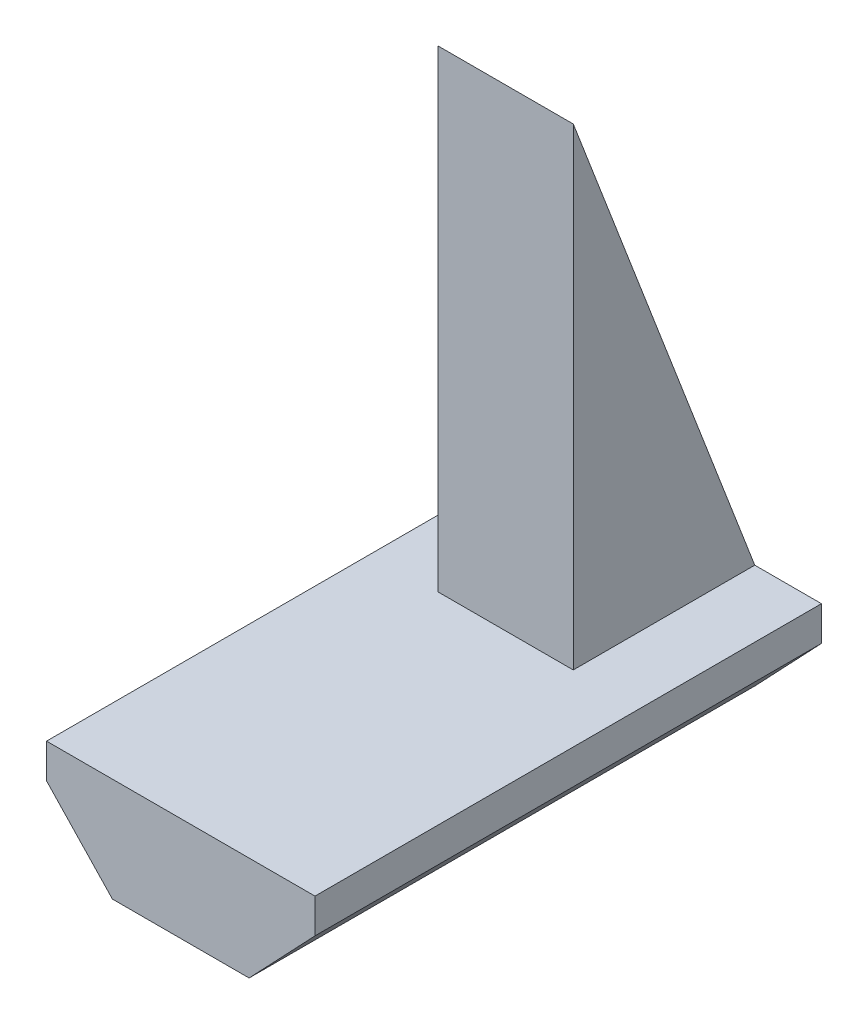
ISO-10303-21;
HEADER;
FILE_DESCRIPTION(('STEP AP214'),'2;1');
FILE_NAME('part.step','',(''),(''),'','','');
FILE_SCHEMA(('AUTOMOTIVE_DESIGN { 1 0 10303 214 1 1 1 1 }'));
ENDSEC;
DATA;
#1=APPLICATION_CONTEXT('core data for automotive mechanical design processes');
#2=APPLICATION_PROTOCOL_DEFINITION('international standard','automotive_design',2000,#1);
#3=PRODUCT_CONTEXT('',#1,'mechanical');
#4=PRODUCT('Part','Part','',(#3));
#5=PRODUCT_RELATED_PRODUCT_CATEGORY('part','',(#4));
#6=PRODUCT_DEFINITION_FORMATION('','',#4);
#7=PRODUCT_DEFINITION_CONTEXT('part definition',#1,'design');
#8=PRODUCT_DEFINITION('design','',#6,#7);
#9=PRODUCT_DEFINITION_SHAPE('','',#8);
#10=(LENGTH_UNIT() NAMED_UNIT(*) SI_UNIT(.MILLI.,.METRE.));
#11=(NAMED_UNIT(*) PLANE_ANGLE_UNIT() SI_UNIT($,.RADIAN.));
#12=(NAMED_UNIT(*) SI_UNIT($,.STERADIAN.) SOLID_ANGLE_UNIT());
#13=UNCERTAINTY_MEASURE_WITH_UNIT(LENGTH_MEASURE(1.E-05),#10,'distance_accuracy_value','');
#14=(GEOMETRIC_REPRESENTATION_CONTEXT(3) GLOBAL_UNCERTAINTY_ASSIGNED_CONTEXT((#13)) GLOBAL_UNIT_ASSIGNED_CONTEXT((#10,
#11,#12)) REPRESENTATION_CONTEXT('',''));
#15=CARTESIAN_POINT('',(0.,0.,0.));
#16=DIRECTION('',(0.,0.,1.));
#17=DIRECTION('',(1.,0.,0.));
#18=AXIS2_PLACEMENT_3D('',#15,#16,#17);
#19=CARTESIAN_POINT('',(0.,0.,30.));
#20=DIRECTION('',(0.,1.,0.));
#21=DIRECTION('',(-1.,0.,0.));
#22=AXIS2_PLACEMENT_3D('',#19,#20,#21);
#23=PLANE('',#22);
#24=DIRECTION('',(1.,0.,0.));
#25=VECTOR('',#24,1.);
#26=CARTESIAN_POINT('',(0.,0.,0.));
#27=LINE('',#26,#25);
#28=CARTESIAN_POINT('',(4.,0.,0.));
#29=VERTEX_POINT('',#28);
#30=CARTESIAN_POINT('',(7.95,0.,0.));
#31=VERTEX_POINT('',#30);
#32=EDGE_CURVE('E64',#29,#31,#27,.T.);
#33=ORIENTED_EDGE('',*,*,#32,.F.);
#34=DIRECTION('',(0.,0.,1.));
#35=VECTOR('',#34,1.);
#36=CARTESIAN_POINT('',(4.,0.,10.7510384863591));
#37=LINE('',#36,#35);
#38=CARTESIAN_POINT('',(4.,0.,10.7510384863591));
#39=VERTEX_POINT('',#38);
#40=EDGE_CURVE('E59',#29,#39,#37,.T.);
#41=ORIENTED_EDGE('',*,*,#40,.T.);
#42=DIRECTION('',(1.,0.,0.));
#43=VECTOR('',#42,1.);
#44=CARTESIAN_POINT('',(-4.,0.,10.7510384863591));
#45=LINE('',#44,#43);
#46=CARTESIAN_POINT('',(-4.,0.,10.7510384863591));
#47=VERTEX_POINT('',#46);
#48=EDGE_CURVE('E111',#47,#39,#45,.T.);
#49=ORIENTED_EDGE('',*,*,#48,.F.);
#50=DIRECTION('',(0.,0.,1.));
#51=VECTOR('',#50,1.);
#52=CARTESIAN_POINT('',(-4.,0.,10.7510384863591));
#53=LINE('',#52,#51);
#54=CARTESIAN_POINT('',(-4.,0.,0.));
#55=VERTEX_POINT('',#54);
#56=EDGE_CURVE('E115',#55,#47,#53,.T.);
#57=ORIENTED_EDGE('',*,*,#56,.F.);
#58=CARTESIAN_POINT('',(-7.95,0.,0.));
#59=VERTEX_POINT('',#58);
#60=EDGE_CURVE('E158',#59,#55,#27,.T.);
#61=ORIENTED_EDGE('',*,*,#60,.F.);
#62=DIRECTION('',(0.,0.,-1.));
#63=VECTOR('',#62,1.);
#64=CARTESIAN_POINT('',(-7.95,0.,30.));
#65=LINE('',#64,#63);
#66=CARTESIAN_POINT('',(-7.95,0.,30.));
#67=VERTEX_POINT('',#66);
#68=EDGE_CURVE('E178',#67,#59,#65,.T.);
#69=ORIENTED_EDGE('',*,*,#68,.F.);
#70=DIRECTION('',(1.,0.,0.));
#71=VECTOR('',#70,1.);
#72=CARTESIAN_POINT('',(0.,0.,30.));
#73=LINE('',#72,#71);
#74=CARTESIAN_POINT('',(7.95,0.,30.));
#75=VERTEX_POINT('',#74);
#76=EDGE_CURVE('E174',#67,#75,#73,.T.);
#77=ORIENTED_EDGE('',*,*,#76,.T.);
#78=DIRECTION('',(0.,0.,-1.));
#79=VECTOR('',#78,1.);
#80=CARTESIAN_POINT('',(7.95,0.,30.));
#81=LINE('',#80,#79);
#82=EDGE_CURVE('E202',#75,#31,#81,.T.);
#83=ORIENTED_EDGE('',*,*,#82,.T.);
#84=EDGE_LOOP('',(#33,#41,#49,#57,#61,#69,#77,#83));
#85=FACE_BOUND('',#84,.T.);
#86=ADVANCED_FACE('F43',(#85),#23,.T.);
#87=CARTESIAN_POINT('',(-7.95,0.,30.));
#88=DIRECTION('',(-1.,0.,0.));
#89=DIRECTION('',(0.,-1.,0.));
#90=AXIS2_PLACEMENT_3D('',#87,#88,#89);
#91=PLANE('',#90);
#92=DIRECTION('',(0.,1.,0.));
#93=VECTOR('',#92,1.);
#94=CARTESIAN_POINT('',(-7.95,0.,0.));
#95=LINE('',#94,#93);
#96=CARTESIAN_POINT('',(-7.95,-2.04,0.));
#97=VERTEX_POINT('',#96);
#98=EDGE_CURVE('E119',#97,#59,#95,.T.);
#99=ORIENTED_EDGE('',*,*,#98,.F.);
#100=DIRECTION('',(0.,0.,-1.));
#101=VECTOR('',#100,1.);
#102=CARTESIAN_POINT('',(-7.95,-2.04,30.));
#103=LINE('',#102,#101);
#104=CARTESIAN_POINT('',(-7.95,-2.04,30.));
#105=VERTEX_POINT('',#104);
#106=EDGE_CURVE('E11',#105,#97,#103,.T.);
#107=ORIENTED_EDGE('',*,*,#106,.F.);
#108=DIRECTION('',(0.,1.,0.));
#109=VECTOR('',#108,1.);
#110=CARTESIAN_POINT('',(-7.95,0.,30.));
#111=LINE('',#110,#109);
#112=EDGE_CURVE('E153',#105,#67,#111,.T.);
#113=ORIENTED_EDGE('',*,*,#112,.T.);
#114=ORIENTED_EDGE('',*,*,#68,.T.);
#115=EDGE_LOOP('',(#99,#107,#113,#114));
#116=FACE_BOUND('',#115,.T.);
#117=ADVANCED_FACE('F45',(#116),#91,.T.);
#118=CARTESIAN_POINT('',(-5.20217481392665,-4.93600140143796,30.));
#119=DIRECTION('',(-0.725421588273713,-0.688304815664138,0.));
#120=DIRECTION('',(0.688304815664138,-0.725421588273713,0.));
#121=AXIS2_PLACEMENT_3D('',#118,#119,#120);
#122=PLANE('',#121);
#123=DIRECTION('',(-0.688304815664138,0.725421588273713,0.));
#124=VECTOR('',#123,1.);
#125=CARTESIAN_POINT('',(-5.20217481392665,-4.93600140143796,0.));
#126=LINE('',#125,#124);
#127=CARTESIAN_POINT('',(-4.048,-6.15241498392368,0.));
#128=VERTEX_POINT('',#127);
#129=EDGE_CURVE('E182',#128,#97,#126,.T.);
#130=ORIENTED_EDGE('',*,*,#129,.F.);
#131=DIRECTION('',(0.,0.,-1.));
#132=VECTOR('',#131,1.);
#133=CARTESIAN_POINT('',(-4.048,-6.15241498392368,30.));
#134=LINE('',#133,#132);
#135=CARTESIAN_POINT('',(-4.048,-6.15241498392368,30.));
#136=VERTEX_POINT('',#135);
#137=EDGE_CURVE('E52',#136,#128,#134,.T.);
#138=ORIENTED_EDGE('',*,*,#137,.F.);
#139=DIRECTION('',(-0.688304815664138,0.725421588273713,0.));
#140=VECTOR('',#139,1.);
#141=CARTESIAN_POINT('',(-5.20217481392665,-4.93600140143796,30.));
#142=LINE('',#141,#140);
#143=EDGE_CURVE('E157',#136,#105,#142,.T.);
#144=ORIENTED_EDGE('',*,*,#143,.T.);
#145=ORIENTED_EDGE('',*,*,#106,.T.);
#146=EDGE_LOOP('',(#130,#138,#144,#145));
#147=FACE_BOUND('',#146,.T.);
#148=ADVANCED_FACE('F218',(#147),#122,.T.);
#149=CARTESIAN_POINT('',(0.,-6.15241498392368,30.));
#150=DIRECTION('',(0.,-1.,0.));
#151=DIRECTION('',(1.,0.,0.));
#152=AXIS2_PLACEMENT_3D('',#149,#150,#151);
#153=PLANE('',#152);
#154=DIRECTION('',(-1.,0.,0.));
#155=VECTOR('',#154,1.);
#156=CARTESIAN_POINT('',(0.,-6.15241498392368,0.));
#157=LINE('',#156,#155);
#158=CARTESIAN_POINT('',(4.048,-6.15241498392368,0.));
#159=VERTEX_POINT('',#158);
#160=EDGE_CURVE('E186',#159,#128,#157,.T.);
#161=ORIENTED_EDGE('',*,*,#160,.F.);
#162=DIRECTION('',(0.,0.,-1.));
#163=VECTOR('',#162,1.);
#164=CARTESIAN_POINT('',(4.048,-6.15241498392368,30.));
#165=LINE('',#164,#163);
#166=CARTESIAN_POINT('',(4.048,-6.15241498392368,30.));
#167=VERTEX_POINT('',#166);
#168=EDGE_CURVE('E208',#167,#159,#165,.T.);
#169=ORIENTED_EDGE('',*,*,#168,.F.);
#170=DIRECTION('',(-1.,0.,0.));
#171=VECTOR('',#170,1.);
#172=CARTESIAN_POINT('',(0.,-6.15241498392368,30.));
#173=LINE('',#172,#171);
#174=EDGE_CURVE('E162',#167,#136,#173,.T.);
#175=ORIENTED_EDGE('',*,*,#174,.T.);
#176=ORIENTED_EDGE('',*,*,#137,.T.);
#177=EDGE_LOOP('',(#161,#169,#175,#176));
#178=FACE_BOUND('',#177,.T.);
#179=ADVANCED_FACE('F214',(#178),#153,.T.);
#180=CARTESIAN_POINT('',(5.20217481392665,-4.93600140143796,30.));
#181=DIRECTION('',(0.725421588273714,-0.688304815664138,0.));
#182=DIRECTION('',(0.688304815664138,0.725421588273714,0.));
#183=AXIS2_PLACEMENT_3D('',#180,#181,#182);
#184=PLANE('',#183);
#185=DIRECTION('',(-0.688304815664138,-0.725421588273714,0.));
#186=VECTOR('',#185,1.);
#187=CARTESIAN_POINT('',(5.20217481392665,-4.93600140143796,0.));
#188=LINE('',#187,#186);
#189=CARTESIAN_POINT('',(7.95,-2.04,0.));
#190=VERTEX_POINT('',#189);
#191=EDGE_CURVE('E190',#190,#159,#188,.T.);
#192=ORIENTED_EDGE('',*,*,#191,.F.);
#193=DIRECTION('',(0.,0.,-1.));
#194=VECTOR('',#193,1.);
#195=CARTESIAN_POINT('',(7.95,-2.04,30.));
#196=LINE('',#195,#194);
#197=CARTESIAN_POINT('',(7.95,-2.04,30.));
#198=VERTEX_POINT('',#197);
#199=EDGE_CURVE('E205',#198,#190,#196,.T.);
#200=ORIENTED_EDGE('',*,*,#199,.F.);
#201=DIRECTION('',(-0.688304815664138,-0.725421588273714,0.));
#202=VECTOR('',#201,1.);
#203=CARTESIAN_POINT('',(5.20217481392665,-4.93600140143796,30.));
#204=LINE('',#203,#202);
#205=EDGE_CURVE('E166',#198,#167,#204,.T.);
#206=ORIENTED_EDGE('',*,*,#205,.T.);
#207=ORIENTED_EDGE('',*,*,#168,.T.);
#208=EDGE_LOOP('',(#192,#200,#206,#207));
#209=FACE_BOUND('',#208,.T.);
#210=ADVANCED_FACE('F225',(#209),#184,.T.);
#211=CARTESIAN_POINT('',(7.95,0.,30.));
#212=DIRECTION('',(1.,0.,0.));
#213=DIRECTION('',(0.,1.,0.));
#214=AXIS2_PLACEMENT_3D('',#211,#212,#213);
#215=PLANE('',#214);
#216=DIRECTION('',(0.,-1.,0.));
#217=VECTOR('',#216,1.);
#218=CARTESIAN_POINT('',(7.95,0.,0.));
#219=LINE('',#218,#217);
#220=EDGE_CURVE('E194',#31,#190,#219,.T.);
#221=ORIENTED_EDGE('',*,*,#220,.F.);
#222=ORIENTED_EDGE('',*,*,#82,.F.);
#223=DIRECTION('',(0.,-1.,0.));
#224=VECTOR('',#223,1.);
#225=CARTESIAN_POINT('',(7.95,0.,30.));
#226=LINE('',#225,#224);
#227=EDGE_CURVE('E170',#75,#198,#226,.T.);
#228=ORIENTED_EDGE('',*,*,#227,.T.);
#229=ORIENTED_EDGE('',*,*,#199,.T.);
#230=EDGE_LOOP('',(#221,#222,#228,#229));
#231=FACE_BOUND('',#230,.T.);
#232=ADVANCED_FACE('F234',(#231),#215,.T.);
#233=CARTESIAN_POINT('',(0.,0.,30.));
#234=DIRECTION('',(0.,0.,1.));
#235=DIRECTION('',(1.,0.,0.));
#236=AXIS2_PLACEMENT_3D('',#233,#234,#235);
#237=PLANE('',#236);
#238=ORIENTED_EDGE('',*,*,#112,.F.);
#239=ORIENTED_EDGE('',*,*,#143,.F.);
#240=ORIENTED_EDGE('',*,*,#174,.F.);
#241=ORIENTED_EDGE('',*,*,#205,.F.);
#242=ORIENTED_EDGE('',*,*,#227,.F.);
#243=ORIENTED_EDGE('',*,*,#76,.F.);
#244=EDGE_LOOP('',(#238,#239,#240,#241,#242,#243));
#245=FACE_BOUND('',#244,.T.);
#246=ADVANCED_FACE('F229',(#245),#237,.T.);
#247=CARTESIAN_POINT('',(0.,0.,0.));
#248=DIRECTION('',(0.,0.,1.));
#249=DIRECTION('',(1.,0.,0.));
#250=AXIS2_PLACEMENT_3D('',#247,#248,#249);
#251=PLANE('',#250);
#252=ORIENTED_EDGE('',*,*,#98,.T.);
#253=ORIENTED_EDGE('',*,*,#60,.T.);
#254=DIRECTION('',(1.,0.,0.));
#255=VECTOR('',#254,1.);
#256=CARTESIAN_POINT('',(-4.,0.,0.));
#257=LINE('',#256,#255);
#258=EDGE_CURVE('E144',#55,#29,#257,.T.);
#259=ORIENTED_EDGE('',*,*,#258,.T.);
#260=ORIENTED_EDGE('',*,*,#32,.T.);
#261=ORIENTED_EDGE('',*,*,#220,.T.);
#262=ORIENTED_EDGE('',*,*,#191,.T.);
#263=ORIENTED_EDGE('',*,*,#160,.T.);
#264=ORIENTED_EDGE('',*,*,#129,.T.);
#265=EDGE_LOOP('',(#252,#253,#259,#260,#261,#262,#263,#264));
#266=FACE_BOUND('',#265,.T.);
#267=ADVANCED_FACE('F221',(#266),#251,.F.);
#268=CARTESIAN_POINT('',(-4.,28.007412794916,10.7510384863591));
#269=DIRECTION('',(0.,0.,-1.));
#270=DIRECTION('',(0.,1.,0.));
#271=AXIS2_PLACEMENT_3D('',#268,#269,#270);
#272=PLANE('',#271);
#273=DIRECTION('',(0.,1.,0.));
#274=VECTOR('',#273,1.);
#275=CARTESIAN_POINT('',(4.,28.007412794916,10.7510384863591));
#276=LINE('',#275,#274);
#277=CARTESIAN_POINT('',(4.,28.007412794916,10.7510384863591));
#278=VERTEX_POINT('',#277);
#279=EDGE_CURVE('E139',#39,#278,#276,.T.);
#280=ORIENTED_EDGE('',*,*,#279,.T.);
#281=DIRECTION('',(1.,0.,0.));
#282=VECTOR('',#281,1.);
#283=CARTESIAN_POINT('',(-4.,28.007412794916,10.7510384863591));
#284=LINE('',#283,#282);
#285=CARTESIAN_POINT('',(-4.,28.007412794916,10.7510384863591));
#286=VERTEX_POINT('',#285);
#287=EDGE_CURVE('E120',#286,#278,#284,.T.);
#288=ORIENTED_EDGE('',*,*,#287,.F.);
#289=DIRECTION('',(0.,1.,0.));
#290=VECTOR('',#289,1.);
#291=CARTESIAN_POINT('',(-4.,28.007412794916,10.7510384863591));
#292=LINE('',#291,#290);
#293=EDGE_CURVE('E123',#47,#286,#292,.T.);
#294=ORIENTED_EDGE('',*,*,#293,.F.);
#295=ORIENTED_EDGE('',*,*,#48,.T.);
#296=EDGE_LOOP('',(#280,#288,#294,#295));
#297=FACE_BOUND('',#296,.T.);
#298=ADVANCED_FACE('F124',(#297),#272,.F.);
#299=CARTESIAN_POINT('',(-4.,0.,0.));
#300=DIRECTION('',(0.,-0.358367949545304,0.9335804264972));
#301=DIRECTION('',(0.,-0.9335804264972,-0.358367949545304));
#302=AXIS2_PLACEMENT_3D('',#299,#300,#301);
#303=PLANE('',#302);
#304=DIRECTION('',(0.,-0.9335804264972,-0.358367949545304));
#305=VECTOR('',#304,1.);
#306=CARTESIAN_POINT('',(4.,0.,0.));
#307=LINE('',#306,#305);
#308=EDGE_CURVE('E135',#278,#29,#307,.T.);
#309=ORIENTED_EDGE('',*,*,#308,.T.);
#310=ORIENTED_EDGE('',*,*,#258,.F.);
#311=DIRECTION('',(0.,-0.9335804264972,-0.358367949545304));
#312=VECTOR('',#311,1.);
#313=CARTESIAN_POINT('',(-4.,0.,0.));
#314=LINE('',#313,#312);
#315=EDGE_CURVE('E130',#286,#55,#314,.T.);
#316=ORIENTED_EDGE('',*,*,#315,.F.);
#317=ORIENTED_EDGE('',*,*,#287,.T.);
#318=EDGE_LOOP('',(#309,#310,#316,#317));
#319=FACE_BOUND('',#318,.T.);
#320=ADVANCED_FACE('F253',(#319),#303,.F.);
#321=CARTESIAN_POINT('',(-4.,0.,0.));
#322=DIRECTION('',(-1.,0.,0.));
#323=DIRECTION('',(0.,0.,1.));
#324=AXIS2_PLACEMENT_3D('',#321,#322,#323);
#325=PLANE('',#324);
#326=ORIENTED_EDGE('',*,*,#56,.T.);
#327=ORIENTED_EDGE('',*,*,#293,.T.);
#328=ORIENTED_EDGE('',*,*,#315,.T.);
#329=EDGE_LOOP('',(#326,#327,#328));
#330=FACE_BOUND('',#329,.T.);
#331=ADVANCED_FACE('F132',(#330),#325,.T.);
#332=CARTESIAN_POINT('',(4.,0.,0.));
#333=DIRECTION('',(-1.,0.,0.));
#334=DIRECTION('',(0.,0.,1.));
#335=AXIS2_PLACEMENT_3D('',#332,#333,#334);
#336=PLANE('',#335);
#337=ORIENTED_EDGE('',*,*,#40,.F.);
#338=ORIENTED_EDGE('',*,*,#308,.F.);
#339=ORIENTED_EDGE('',*,*,#279,.F.);
#340=EDGE_LOOP('',(#337,#338,#339));
#341=FACE_BOUND('',#340,.T.);
#342=ADVANCED_FACE('F257',(#341),#336,.F.);
#343=CLOSED_SHELL('',(#86,#117,#148,#179,#210,#232,#246,#267,#298,#320,#331,#342));
#344=MANIFOLD_SOLID_BREP('B2',#343);
#345=ADVANCED_BREP_SHAPE_REPRESENTATION('',(#18,#344),#14);
#346=SHAPE_DEFINITION_REPRESENTATION(#9,#345);
ENDSEC;
END-ISO-10303-21;
